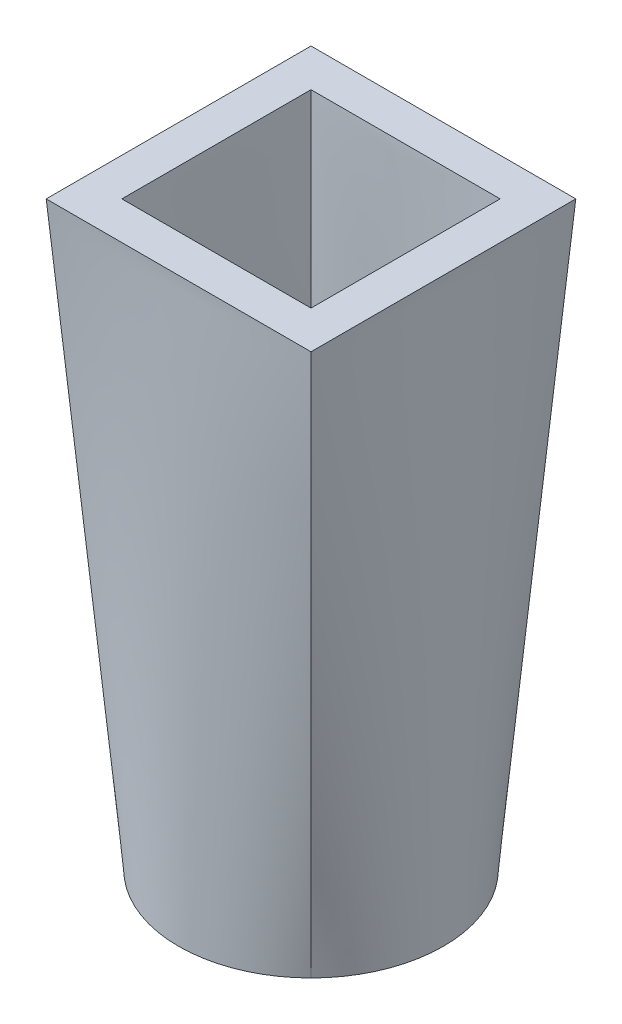
ISO-10303-21;
HEADER;
FILE_DESCRIPTION(('STEP AP214'),'2;1');
FILE_NAME('part.step','',(''),(''),'','','');
FILE_SCHEMA(('AUTOMOTIVE_DESIGN { 1 0 10303 214 1 1 1 1 }'));
ENDSEC;
DATA;
#1=APPLICATION_CONTEXT('core data for automotive mechanical design processes');
#2=APPLICATION_PROTOCOL_DEFINITION('international standard','automotive_design',2000,#1);
#3=PRODUCT_CONTEXT('',#1,'mechanical');
#4=PRODUCT('Part','Part','',(#3));
#5=PRODUCT_RELATED_PRODUCT_CATEGORY('part','',(#4));
#6=PRODUCT_DEFINITION_FORMATION('','',#4);
#7=PRODUCT_DEFINITION_CONTEXT('part definition',#1,'design');
#8=PRODUCT_DEFINITION('design','',#6,#7);
#9=PRODUCT_DEFINITION_SHAPE('','',#8);
#10=(LENGTH_UNIT() NAMED_UNIT(*) SI_UNIT(.MILLI.,.METRE.));
#11=(NAMED_UNIT(*) PLANE_ANGLE_UNIT() SI_UNIT($,.RADIAN.));
#12=(NAMED_UNIT(*) SI_UNIT($,.STERADIAN.) SOLID_ANGLE_UNIT());
#13=UNCERTAINTY_MEASURE_WITH_UNIT(LENGTH_MEASURE(1.E-05),#10,'distance_accuracy_value','');
#14=(GEOMETRIC_REPRESENTATION_CONTEXT(3) GLOBAL_UNCERTAINTY_ASSIGNED_CONTEXT((#13)) GLOBAL_UNIT_ASSIGNED_CONTEXT((#10,
#11,#12)) REPRESENTATION_CONTEXT('',''));
#15=CARTESIAN_POINT('',(0.,0.,0.));
#16=DIRECTION('',(0.,0.,1.));
#17=DIRECTION('',(1.,0.,0.));
#18=AXIS2_PLACEMENT_3D('',#15,#16,#17);
#19=CARTESIAN_POINT('',(0.,0.,0.));
#20=DIRECTION('',(0.,1.,0.));
#21=DIRECTION('',(0.,0.,1.));
#22=AXIS2_PLACEMENT_3D('',#19,#20,#21);
#23=PLANE('',#22);
#24=CARTESIAN_POINT('',(0.,0.,0.));
#25=DIRECTION('',(0.,1.,0.));
#26=DIRECTION('',(0.,0.,1.));
#27=AXIS2_PLACEMENT_3D('',#24,#25,#26);
#28=CIRCLE('',#27,25.);
#29=CARTESIAN_POINT('',(-17.6776695296637,0.,17.6776695296636));
#30=VERTEX_POINT('',#29);
#31=CARTESIAN_POINT('',(17.6776695296637,0.,17.6776695296637));
#32=VERTEX_POINT('',#31);
#33=EDGE_CURVE('E95',#30,#32,#28,.T.);
#34=ORIENTED_EDGE('',*,*,#33,.T.);
#35=CARTESIAN_POINT('',(17.6776695296637,0.,-17.6776695296637));
#36=VERTEX_POINT('',#35);
#37=EDGE_CURVE('E160',#32,#36,#28,.T.);
#38=ORIENTED_EDGE('',*,*,#37,.T.);
#39=CARTESIAN_POINT('',(-17.6776695296636,0.,-17.6776695296637));
#40=VERTEX_POINT('',#39);
#41=EDGE_CURVE('E172',#36,#40,#28,.T.);
#42=ORIENTED_EDGE('',*,*,#41,.T.);
#43=EDGE_CURVE('E182',#40,#30,#28,.T.);
#44=ORIENTED_EDGE('',*,*,#43,.T.);
#45=EDGE_LOOP('',(#34,#38,#42,#44));
#46=FACE_BOUND('',#45,.T.);
#47=CARTESIAN_POINT('',(0.,0.,0.));
#48=DIRECTION('',(0.,1.,0.));
#49=DIRECTION('',(0.,0.,1.));
#50=AXIS2_PLACEMENT_3D('',#47,#48,#49);
#51=CIRCLE('',#50,35.);
#52=CARTESIAN_POINT('',(24.7487373415291,0.,24.7487373415292));
#53=VERTEX_POINT('',#52);
#54=CARTESIAN_POINT('',(24.7487373415292,0.,-24.7487373415291));
#55=VERTEX_POINT('',#54);
#56=EDGE_CURVE('E171',#53,#55,#51,.T.);
#57=ORIENTED_EDGE('',*,*,#56,.F.);
#58=CARTESIAN_POINT('',(0.,0.,0.));
#59=DIRECTION('',(0.,1.,0.));
#60=DIRECTION('',(0.,0.,1.));
#61=AXIS2_PLACEMENT_3D('',#58,#59,#60);
#62=CIRCLE('',#61,35.);
#63=CARTESIAN_POINT('',(-24.7487373415292,0.,24.7487373415291));
#64=VERTEX_POINT('',#63);
#65=EDGE_CURVE('E589',#64,#53,#62,.T.);
#66=ORIENTED_EDGE('',*,*,#65,.F.);
#67=CARTESIAN_POINT('',(0.,0.,0.));
#68=DIRECTION('',(0.,1.,0.));
#69=DIRECTION('',(0.,0.,1.));
#70=AXIS2_PLACEMENT_3D('',#67,#68,#69);
#71=CIRCLE('',#70,35.);
#72=CARTESIAN_POINT('',(-24.7487373415291,0.,-24.7487373415292));
#73=VERTEX_POINT('',#72);
#74=EDGE_CURVE('E579',#73,#64,#71,.T.);
#75=ORIENTED_EDGE('',*,*,#74,.F.);
#76=CARTESIAN_POINT('',(0.,0.,0.));
#77=DIRECTION('',(0.,1.,0.));
#78=DIRECTION('',(0.,0.,1.));
#79=AXIS2_PLACEMENT_3D('',#76,#77,#78);
#80=CIRCLE('',#79,35.);
#81=EDGE_CURVE('E569',#55,#73,#80,.T.);
#82=ORIENTED_EDGE('',*,*,#81,.F.);
#83=EDGE_LOOP('',(#57,#66,#75,#82));
#84=FACE_BOUND('',#83,.T.);
#85=ADVANCED_FACE('F91',(#46,#84),#23,.F.);
#86=CARTESIAN_POINT('',(0.,153.617019002257,0.));
#87=DIRECTION('',(0.,-1.,0.));
#88=DIRECTION('',(0.,0.,-1.));
#89=AXIS2_PLACEMENT_3D('',#86,#87,#88);
#90=PLANE('',#89);
#91=DIRECTION('',(-1.,0.,0.));
#92=VECTOR('',#91,1.);
#93=CARTESIAN_POINT('',(-25.,153.617019002257,-25.));
#94=LINE('',#93,#92);
#95=CARTESIAN_POINT('',(25.,153.617019002257,-25.));
#96=VERTEX_POINT('',#95);
#97=CARTESIAN_POINT('',(-25.,153.617019002257,-25.));
#98=VERTEX_POINT('',#97);
#99=EDGE_CURVE('E216',#96,#98,#94,.T.);
#100=ORIENTED_EDGE('',*,*,#99,.F.);
#101=DIRECTION('',(0.,0.,-1.));
#102=VECTOR('',#101,1.);
#103=CARTESIAN_POINT('',(25.,153.617019002257,25.));
#104=LINE('',#103,#102);
#105=CARTESIAN_POINT('',(25.,153.617019002257,25.));
#106=VERTEX_POINT('',#105);
#107=EDGE_CURVE('E227',#106,#96,#104,.T.);
#108=ORIENTED_EDGE('',*,*,#107,.F.);
#109=DIRECTION('',(1.,0.,0.));
#110=VECTOR('',#109,1.);
#111=CARTESIAN_POINT('',(-25.,153.617019002257,25.));
#112=LINE('',#111,#110);
#113=CARTESIAN_POINT('',(-25.,153.617019002257,25.));
#114=VERTEX_POINT('',#113);
#115=EDGE_CURVE('E176',#114,#106,#112,.T.);
#116=ORIENTED_EDGE('',*,*,#115,.F.);
#117=DIRECTION('',(0.,0.,1.));
#118=VECTOR('',#117,1.);
#119=CARTESIAN_POINT('',(-25.,153.617019002257,25.));
#120=LINE('',#119,#118);
#121=EDGE_CURVE('E208',#98,#114,#120,.T.);
#122=ORIENTED_EDGE('',*,*,#121,.F.);
#123=EDGE_LOOP('',(#100,#108,#116,#122));
#124=FACE_BOUND('',#123,.T.);
#125=DIRECTION('',(0.,0.,-1.));
#126=VECTOR('',#125,1.);
#127=CARTESIAN_POINT('',(35.,153.617019002257,35.));
#128=LINE('',#127,#126);
#129=CARTESIAN_POINT('',(35.,153.617019002257,35.));
#130=VERTEX_POINT('',#129);
#131=CARTESIAN_POINT('',(35.,153.617019002257,-35.));
#132=VERTEX_POINT('',#131);
#133=EDGE_CURVE('E522',#130,#132,#128,.T.);
#134=ORIENTED_EDGE('',*,*,#133,.T.);
#135=DIRECTION('',(1.,0.,0.));
#136=VECTOR('',#135,1.);
#137=CARTESIAN_POINT('',(-35.,153.617019002257,-35.));
#138=LINE('',#137,#136);
#139=CARTESIAN_POINT('',(-35.,153.617019002257,-35.));
#140=VERTEX_POINT('',#139);
#141=EDGE_CURVE('E518',#140,#132,#138,.T.);
#142=ORIENTED_EDGE('',*,*,#141,.F.);
#143=DIRECTION('',(0.,0.,-1.));
#144=VECTOR('',#143,1.);
#145=CARTESIAN_POINT('',(-35.,153.617019002257,35.));
#146=LINE('',#145,#144);
#147=CARTESIAN_POINT('',(-35.,153.617019002257,35.));
#148=VERTEX_POINT('',#147);
#149=EDGE_CURVE('E101',#148,#140,#146,.T.);
#150=ORIENTED_EDGE('',*,*,#149,.F.);
#151=DIRECTION('',(1.,0.,0.));
#152=VECTOR('',#151,1.);
#153=CARTESIAN_POINT('',(-35.,153.617019002257,35.));
#154=LINE('',#153,#152);
#155=EDGE_CURVE('E12',#148,#130,#154,.T.);
#156=ORIENTED_EDGE('',*,*,#155,.T.);
#157=EDGE_LOOP('',(#134,#142,#150,#156));
#158=FACE_BOUND('',#157,.T.);
#159=ADVANCED_FACE('F245',(#124,#158),#90,.F.);
#160=CARTESIAN_POINT('',(-35.,153.617019002257,35.));
#161=CARTESIAN_POINT('',(-24.7487373415292,0.,24.7487373415291));
#162=CARTESIAN_POINT('',(-35.,153.617019002257,32.0833333333333));
#163=CARTESIAN_POINT('',(-26.2070706748625,0.,23.2904040081958));
#164=CARTESIAN_POINT('',(-35.,153.617019002257,29.1666666666667));
#165=CARTESIAN_POINT('',(-27.5902980372642,0.,21.6478916843896));
#166=CARTESIAN_POINT('',(-35.,153.617019002257,23.3333333333333));
#167=CARTESIAN_POINT('',(-30.0875461216728,0.,18.0165293145029));
#168=CARTESIAN_POINT('',(-35.,153.617019002257,20.4166666666666));
#169=CARTESIAN_POINT('',(-31.20075829867,0.,16.0274938237574));
#170=CARTESIAN_POINT('',(-35.,153.617019002257,14.5833333333333));
#171=CARTESIAN_POINT('',(-33.041173161278,0.,11.7749205011775));
#172=CARTESIAN_POINT('',(-35.,153.617019002257,11.6666666666666));
#173=CARTESIAN_POINT('',(-33.7674737720229,0.,9.51171560693941));
#174=CARTESIAN_POINT('',(-35.,153.617019002257,5.83333333333332));
#175=CARTESIAN_POINT('',(-34.7471912688595,0.,4.83194760493541));
#176=CARTESIAN_POINT('',(-35.,153.617019002257,2.91666666666665));
#177=CARTESIAN_POINT('',(-35.,0.,2.41624578050964));
#178=CARTESIAN_POINT('',(-35.,153.617019002257,-2.91666666666668));
#179=CARTESIAN_POINT('',(-35.,0.,-2.4162457805098));
#180=CARTESIAN_POINT('',(-35.,153.617019002257,-5.83333333333334));
#181=CARTESIAN_POINT('',(-34.7471912688595,0.,-4.83194760493556));
#182=CARTESIAN_POINT('',(-35.,153.617019002257,-11.6666666666667));
#183=CARTESIAN_POINT('',(-33.7674737720228,0.,-9.51171560693956));
#184=CARTESIAN_POINT('',(-35.,153.617019002257,-14.5833333333333));
#185=CARTESIAN_POINT('',(-33.0411731612779,0.,-11.7749205011776));
#186=CARTESIAN_POINT('',(-35.,153.617019002257,-20.4166666666667));
#187=CARTESIAN_POINT('',(-31.20075829867,0.,-16.0274938237575));
#188=CARTESIAN_POINT('',(-35.,153.617019002257,-23.3333333333333));
#189=CARTESIAN_POINT('',(-30.0875461216727,0.,-18.016529314503));
#190=CARTESIAN_POINT('',(-35.,153.617019002257,-29.1666666666667));
#191=CARTESIAN_POINT('',(-27.5902980372641,0.,-21.6478916843897));
#192=CARTESIAN_POINT('',(-35.,153.617019002257,-32.0833333333333));
#193=CARTESIAN_POINT('',(-26.2070706748624,0.,-23.2904040081959));
#194=CARTESIAN_POINT('',(-35.,153.617019002257,-35.));
#195=CARTESIAN_POINT('',(-24.7487373415291,0.,-24.7487373415292));
#196=B_SPLINE_SURFACE_WITH_KNOTS('',3,1,((#160,#161),(#162,#163),(#164,#165),(#166,#167),(#168,
#169),(#170,#171),(#172,#173),(#174,#175),(#176,#177),(#178,#179),(#180,#181),(#182,#183),(#184,
#185),(#186,#187),(#188,#189),(#190,#191),(#192,#193),(#194,#195)),.UNSPECIFIED.,.F.,.F.,.F.,(4,
2,2,2,2,2,2,2,4),(2,2),(0.,0.125,0.25,0.375,0.5,0.625,0.75,0.875,1.),(0.,1.),.UNSPECIFIED.);
#197=DIRECTION('',(0.0664373914767903,-0.995576288401607,0.0664373914767895));
#198=VECTOR('',#197,1.);
#199=CARTESIAN_POINT('',(-29.8743686707646,76.8085095011283,-29.8743686707646));
#200=LINE('',#199,#198);
#201=EDGE_CURVE('E527',#140,#73,#200,.T.);
#202=DIRECTION('',(-0.0664373914767896,0.995576288401607,0.0664373914767902));
#203=VECTOR('',#202,1.);
#204=CARTESIAN_POINT('',(-29.8743686707646,76.8085095011283,29.8743686707646));
#205=LINE('',#204,#203);
#206=EDGE_CURVE('E528',#64,#148,#205,.T.);
#207=ORIENTED_EDGE('',*,*,#149,.T.);
#208=ORIENTED_EDGE('',*,*,#201,.T.);
#209=ORIENTED_EDGE('',*,*,#74,.T.);
#210=ORIENTED_EDGE('',*,*,#206,.T.);
#211=EDGE_LOOP('',(#207,#208,#209,#210));
#212=FACE_BOUND('',#211,.T.);
#213=ADVANCED_FACE('F267',(#212),#196,.T.);
#214=CARTESIAN_POINT('',(-35.,153.617019002257,-35.));
#215=CARTESIAN_POINT('',(-24.7487373415291,0.,-24.7487373415292));
#216=CARTESIAN_POINT('',(-32.0833333333333,153.617019002257,-35.));
#217=CARTESIAN_POINT('',(-23.2904040081958,0.,-26.2070706748626));
#218=CARTESIAN_POINT('',(-29.1666666666667,153.617019002257,-35.));
#219=CARTESIAN_POINT('',(-21.6478916843896,0.,-27.5902980372642));
#220=CARTESIAN_POINT('',(-23.3333333333333,153.617019002257,-35.));
#221=CARTESIAN_POINT('',(-18.0165293145029,0.,-30.0875461216728));
#222=CARTESIAN_POINT('',(-20.4166666666667,153.617019002257,-35.));
#223=CARTESIAN_POINT('',(-16.0274938237573,0.,-31.20075829867));
#224=CARTESIAN_POINT('',(-14.5833333333333,153.617019002257,-35.));
#225=CARTESIAN_POINT('',(-11.7749205011775,0.,-33.041173161278));
#226=CARTESIAN_POINT('',(-11.6666666666667,153.617019002257,-35.));
#227=CARTESIAN_POINT('',(-9.51171560693942,0.,-33.7674737720229));
#228=CARTESIAN_POINT('',(-5.83333333333333,153.617019002257,-35.));
#229=CARTESIAN_POINT('',(-4.83194760493542,0.,-34.7471912688595));
#230=CARTESIAN_POINT('',(-2.91666666666667,153.617019002257,-35.));
#231=CARTESIAN_POINT('',(-2.41624578050965,0.,-35.));
#232=CARTESIAN_POINT('',(2.91666666666666,153.617019002257,-35.));
#233=CARTESIAN_POINT('',(2.41624578050979,0.,-35.));
#234=CARTESIAN_POINT('',(5.83333333333333,153.617019002257,-35.));
#235=CARTESIAN_POINT('',(4.83194760493555,0.,-34.7471912688595));
#236=CARTESIAN_POINT('',(11.6666666666667,153.617019002257,-35.));
#237=CARTESIAN_POINT('',(9.51171560693954,0.,-33.7674737720228));
#238=CARTESIAN_POINT('',(14.5833333333333,153.617019002257,-35.));
#239=CARTESIAN_POINT('',(11.7749205011776,0.,-33.0411731612779));
#240=CARTESIAN_POINT('',(20.4166666666667,153.617019002257,-35.));
#241=CARTESIAN_POINT('',(16.0274938237575,0.,-31.20075829867));
#242=CARTESIAN_POINT('',(23.3333333333333,153.617019002257,-35.));
#243=CARTESIAN_POINT('',(18.016529314503,0.,-30.0875461216727));
#244=CARTESIAN_POINT('',(29.1666666666667,153.617019002257,-35.));
#245=CARTESIAN_POINT('',(21.6478916843897,0.,-27.5902980372641));
#246=CARTESIAN_POINT('',(32.0833333333333,153.617019002257,-35.));
#247=CARTESIAN_POINT('',(23.2904040081959,0.,-26.2070706748625));
#248=CARTESIAN_POINT('',(35.,153.617019002257,-35.));
#249=CARTESIAN_POINT('',(24.7487373415292,0.,-24.7487373415291));
#250=B_SPLINE_SURFACE_WITH_KNOTS('',3,1,((#214,#215),(#216,#217),(#218,#219),(#220,#221),(#222,
#223),(#224,#225),(#226,#227),(#228,#229),(#230,#231),(#232,#233),(#234,#235),(#236,#237),(#238,
#239),(#240,#241),(#242,#243),(#244,#245),(#246,#247),(#248,#249)),.UNSPECIFIED.,.F.,.F.,.F.,(4,
2,2,2,2,2,2,2,4),(2,2),(0.,0.125,0.25,0.375,0.5,0.625,0.75,0.875,1.),(0.,1.),.UNSPECIFIED.);
#251=DIRECTION('',(-0.0664373914767896,-0.995576288401607,0.0664373914767901));
#252=VECTOR('',#251,1.);
#253=CARTESIAN_POINT('',(29.8743686707646,76.8085095011283,-29.8743686707646));
#254=LINE('',#253,#252);
#255=EDGE_CURVE('E531',#132,#55,#254,.T.);
#256=ORIENTED_EDGE('',*,*,#141,.T.);
#257=ORIENTED_EDGE('',*,*,#255,.T.);
#258=ORIENTED_EDGE('',*,*,#81,.T.);
#259=ORIENTED_EDGE('',*,*,#201,.F.);
#260=EDGE_LOOP('',(#256,#257,#258,#259));
#261=FACE_BOUND('',#260,.T.);
#262=ADVANCED_FACE('F424',(#261),#250,.T.);
#263=CARTESIAN_POINT('',(35.,153.617019002257,35.));
#264=CARTESIAN_POINT('',(24.7487373415291,0.,24.7487373415292));
#265=CARTESIAN_POINT('',(32.0833333333333,153.617019002257,35.));
#266=CARTESIAN_POINT('',(23.2904040081958,0.,26.2070706748625));
#267=CARTESIAN_POINT('',(29.1666666666667,153.617019002257,35.));
#268=CARTESIAN_POINT('',(21.6478916843896,0.,27.5902980372642));
#269=CARTESIAN_POINT('',(23.3333333333333,153.617019002257,35.));
#270=CARTESIAN_POINT('',(18.0165293145029,0.,30.0875461216727));
#271=CARTESIAN_POINT('',(20.4166666666666,153.617019002257,35.));
#272=CARTESIAN_POINT('',(16.0274938237574,0.,31.20075829867));
#273=CARTESIAN_POINT('',(14.5833333333333,153.617019002257,35.));
#274=CARTESIAN_POINT('',(11.7749205011775,0.,33.041173161278));
#275=CARTESIAN_POINT('',(11.6666666666666,153.617019002257,35.));
#276=CARTESIAN_POINT('',(9.51171560693942,0.,33.7674737720229));
#277=CARTESIAN_POINT('',(5.83333333333331,153.617019002257,35.));
#278=CARTESIAN_POINT('',(4.83194760493542,0.,34.7471912688595));
#279=CARTESIAN_POINT('',(2.91666666666665,153.617019002257,35.));
#280=CARTESIAN_POINT('',(2.41624578050966,0.,35.));
#281=CARTESIAN_POINT('',(-2.91666666666669,153.617019002257,35.));
#282=CARTESIAN_POINT('',(-2.41624578050979,0.,35.));
#283=CARTESIAN_POINT('',(-5.83333333333336,153.617019002257,35.));
#284=CARTESIAN_POINT('',(-4.83194760493555,0.,34.7471912688595));
#285=CARTESIAN_POINT('',(-11.6666666666667,153.617019002257,35.));
#286=CARTESIAN_POINT('',(-9.51171560693955,0.,33.7674737720228));
#287=CARTESIAN_POINT('',(-14.5833333333334,153.617019002257,35.));
#288=CARTESIAN_POINT('',(-11.7749205011776,0.,33.0411731612779));
#289=CARTESIAN_POINT('',(-20.4166666666667,153.617019002257,35.));
#290=CARTESIAN_POINT('',(-16.0274938237575,0.,31.20075829867));
#291=CARTESIAN_POINT('',(-23.3333333333334,153.617019002257,35.));
#292=CARTESIAN_POINT('',(-18.016529314503,0.,30.0875461216727));
#293=CARTESIAN_POINT('',(-29.1666666666667,153.617019002257,35.));
#294=CARTESIAN_POINT('',(-21.6478916843897,0.,27.5902980372641));
#295=CARTESIAN_POINT('',(-32.0833333333333,153.617019002257,35.));
#296=CARTESIAN_POINT('',(-23.2904040081959,0.,26.2070706748624));
#297=CARTESIAN_POINT('',(-35.,153.617019002257,35.));
#298=CARTESIAN_POINT('',(-24.7487373415292,0.,24.7487373415291));
#299=B_SPLINE_SURFACE_WITH_KNOTS('',3,1,((#263,#264),(#265,#266),(#267,#268),(#269,#270),(#271,
#272),(#273,#274),(#275,#276),(#277,#278),(#279,#280),(#281,#282),(#283,#284),(#285,#286),(#287,
#288),(#289,#290),(#291,#292),(#293,#294),(#295,#296),(#297,#298)),.UNSPECIFIED.,.F.,.F.,.F.,(4,
2,2,2,2,2,2,2,4),(2,2),(0.,0.125,0.25,0.375,0.5,0.625,0.75,0.875,1.),(0.,1.),.UNSPECIFIED.);
#300=DIRECTION('',(-0.0664373914767902,-0.995576288401607,-0.0664373914767896));
#301=VECTOR('',#300,1.);
#302=CARTESIAN_POINT('',(29.8743686707646,76.8085095011283,29.8743686707646));
#303=LINE('',#302,#301);
#304=EDGE_CURVE('E591',#130,#53,#303,.T.);
#305=ORIENTED_EDGE('',*,*,#155,.F.);
#306=ORIENTED_EDGE('',*,*,#206,.F.);
#307=ORIENTED_EDGE('',*,*,#65,.T.);
#308=ORIENTED_EDGE('',*,*,#304,.F.);
#309=EDGE_LOOP('',(#305,#306,#307,#308));
#310=FACE_BOUND('',#309,.T.);
#311=ADVANCED_FACE('F431',(#310),#299,.T.);
#312=CARTESIAN_POINT('',(35.,153.617019002257,-35.));
#313=CARTESIAN_POINT('',(24.7487373415292,0.,-24.7487373415291));
#314=CARTESIAN_POINT('',(35.,153.617019002257,-32.0833333333333));
#315=CARTESIAN_POINT('',(26.2070706748625,0.,-23.2904040081958));
#316=CARTESIAN_POINT('',(35.,153.617019002257,-29.1666666666667));
#317=CARTESIAN_POINT('',(27.5902980372642,0.,-21.6478916843896));
#318=CARTESIAN_POINT('',(35.,153.617019002257,-23.3333333333333));
#319=CARTESIAN_POINT('',(30.0875461216727,0.,-18.0165293145029));
#320=CARTESIAN_POINT('',(35.,153.617019002257,-20.4166666666667));
#321=CARTESIAN_POINT('',(31.20075829867,0.,-16.0274938237574));
#322=CARTESIAN_POINT('',(35.,153.617019002257,-14.5833333333333));
#323=CARTESIAN_POINT('',(33.041173161278,0.,-11.7749205011775));
#324=CARTESIAN_POINT('',(35.,153.617019002257,-11.6666666666667));
#325=CARTESIAN_POINT('',(33.7674737720229,0.,-9.51171560693943));
#326=CARTESIAN_POINT('',(35.,153.617019002257,-5.83333333333334));
#327=CARTESIAN_POINT('',(34.7471912688595,0.,-4.83194760493543));
#328=CARTESIAN_POINT('',(35.,153.617019002257,-2.91666666666667));
#329=CARTESIAN_POINT('',(35.,0.,-2.41624578050967));
#330=CARTESIAN_POINT('',(35.,153.617019002257,2.91666666666666));
#331=CARTESIAN_POINT('',(35.,0.,2.41624578050977));
#332=CARTESIAN_POINT('',(35.,153.617019002257,5.83333333333332));
#333=CARTESIAN_POINT('',(34.7471912688595,0.,4.83194760493554));
#334=CARTESIAN_POINT('',(35.,153.617019002257,11.6666666666666));
#335=CARTESIAN_POINT('',(33.7674737720228,0.,9.51171560693954));
#336=CARTESIAN_POINT('',(35.,153.617019002257,14.5833333333333));
#337=CARTESIAN_POINT('',(33.0411731612779,0.,11.7749205011776));
#338=CARTESIAN_POINT('',(35.,153.617019002257,20.4166666666666));
#339=CARTESIAN_POINT('',(31.20075829867,0.,16.0274938237575));
#340=CARTESIAN_POINT('',(35.,153.617019002257,23.3333333333333));
#341=CARTESIAN_POINT('',(30.0875461216727,0.,18.016529314503));
#342=CARTESIAN_POINT('',(35.,153.617019002257,29.1666666666667));
#343=CARTESIAN_POINT('',(27.5902980372641,0.,21.6478916843897));
#344=CARTESIAN_POINT('',(35.,153.617019002257,32.0833333333333));
#345=CARTESIAN_POINT('',(26.2070706748625,0.,23.2904040081959));
#346=CARTESIAN_POINT('',(35.,153.617019002257,35.));
#347=CARTESIAN_POINT('',(24.7487373415291,0.,24.7487373415292));
#348=B_SPLINE_SURFACE_WITH_KNOTS('',3,1,((#312,#313),(#314,#315),(#316,#317),(#318,#319),(#320,
#321),(#322,#323),(#324,#325),(#326,#327),(#328,#329),(#330,#331),(#332,#333),(#334,#335),(#336,
#337),(#338,#339),(#340,#341),(#342,#343),(#344,#345),(#346,#347)),.UNSPECIFIED.,.F.,.F.,.F.,(4,
2,2,2,2,2,2,2,4),(2,2),(0.,0.125,0.25,0.375,0.5,0.625,0.75,0.875,1.),(0.,1.),.UNSPECIFIED.);
#349=ORIENTED_EDGE('',*,*,#133,.F.);
#350=ORIENTED_EDGE('',*,*,#304,.T.);
#351=ORIENTED_EDGE('',*,*,#56,.T.);
#352=ORIENTED_EDGE('',*,*,#255,.F.);
#353=EDGE_LOOP('',(#349,#350,#351,#352));
#354=FACE_BOUND('',#353,.T.);
#355=ADVANCED_FACE('F340',(#354),#348,.T.);
#356=CARTESIAN_POINT('',(17.6776695296637,0.,17.6776695296637));
#357=CARTESIAN_POINT('',(25.,153.617019002257,25.));
#358=CARTESIAN_POINT('',(18.7193361963303,0.,16.6360028629971));
#359=CARTESIAN_POINT('',(25.,153.617019002257,22.9166666666667));
#360=CARTESIAN_POINT('',(19.7073557409029,0.,15.462779774564));
#361=CARTESIAN_POINT('',(25.,153.617019002257,20.8333333333333));
#362=CARTESIAN_POINT('',(21.4911043726233,0.,12.8689495103593));
#363=CARTESIAN_POINT('',(25.,153.617019002257,16.6666666666667));
#364=CARTESIAN_POINT('',(22.2862559276214,0.,11.4482098741125));
#365=CARTESIAN_POINT('',(25.,153.617019002257,14.5833333333333));
#366=CARTESIAN_POINT('',(23.6008379723414,0.,8.41065750084114));
#367=CARTESIAN_POINT('',(25.,153.617019002257,10.4166666666667));
#368=CARTESIAN_POINT('',(24.1196241228734,0.,6.79408257638539));
#369=CARTESIAN_POINT('',(25.,153.617019002257,8.33333333333333));
#370=CARTESIAN_POINT('',(24.8194223348996,0.,3.45139114638253));
#371=CARTESIAN_POINT('',(25.,153.617019002257,4.16666666666666));
#372=CARTESIAN_POINT('',(25.,0.,1.72588984322127));
#373=CARTESIAN_POINT('',(25.,153.617019002257,2.08333333333333));
#374=CARTESIAN_POINT('',(25.,0.,-1.72588984322119));
#375=CARTESIAN_POINT('',(25.,153.617019002257,-2.08333333333334));
#376=CARTESIAN_POINT('',(24.8194223348996,0.,-3.45139114638245));
#377=CARTESIAN_POINT('',(25.,153.617019002257,-4.16666666666667));
#378=CARTESIAN_POINT('',(24.1196241228735,0.,-6.79408257638531));
#379=CARTESIAN_POINT('',(25.,153.617019002257,-8.33333333333334));
#380=CARTESIAN_POINT('',(23.6008379723414,0.,-8.41065750084106));
#381=CARTESIAN_POINT('',(25.,153.617019002257,-10.4166666666667));
#382=CARTESIAN_POINT('',(22.2862559276214,0.,-11.4482098741124));
#383=CARTESIAN_POINT('',(25.,153.617019002257,-14.5833333333333));
#384=CARTESIAN_POINT('',(21.4911043726234,0.,-12.8689495103592));
#385=CARTESIAN_POINT('',(25.,153.617019002257,-16.6666666666667));
#386=CARTESIAN_POINT('',(19.707355740903,0.,-15.462779774564));
#387=CARTESIAN_POINT('',(25.,153.617019002257,-20.8333333333333));
#388=CARTESIAN_POINT('',(18.7193361963304,0.,-16.636002862997));
#389=CARTESIAN_POINT('',(25.,153.617019002257,-22.9166666666667));
#390=CARTESIAN_POINT('',(17.6776695296637,0.,-17.6776695296637));
#391=CARTESIAN_POINT('',(25.,153.617019002257,-25.));
#392=B_SPLINE_SURFACE_WITH_KNOTS('',3,1,((#356,#357),(#358,#359),(#360,#361),(#362,#363),(#364,
#365),(#366,#367),(#368,#369),(#370,#371),(#372,#373),(#374,#375),(#376,#377),(#378,#379),(#380,
#381),(#382,#383),(#384,#385),(#386,#387),(#388,#389),(#390,#391)),.UNSPECIFIED.,.F.,.F.,.F.,(4,
2,2,2,2,2,2,2,4),(2,2),(0.,0.125,0.25,0.375,0.5,0.625,0.75,0.875,1.),(0.,1.),.UNSPECIFIED.);
#393=DIRECTION('',(-0.0475582082129061,-0.997735653198359,-0.0475582082129057));
#394=VECTOR('',#393,1.);
#395=CARTESIAN_POINT('',(21.3388347648318,76.8085095011283,21.3388347648319));
#396=LINE('',#395,#394);
#397=EDGE_CURVE('E163',#106,#32,#396,.T.);
#398=DIRECTION('',(0.0475582082129058,0.997735653198359,-0.0475582082129061));
#399=VECTOR('',#398,1.);
#400=CARTESIAN_POINT('',(21.3388347648319,76.8085095011283,-21.3388347648318));
#401=LINE('',#400,#399);
#402=EDGE_CURVE('E166',#36,#96,#401,.T.);
#403=ORIENTED_EDGE('',*,*,#37,.F.);
#404=ORIENTED_EDGE('',*,*,#397,.F.);
#405=ORIENTED_EDGE('',*,*,#107,.T.);
#406=ORIENTED_EDGE('',*,*,#402,.F.);
#407=EDGE_LOOP('',(#403,#404,#405,#406));
#408=FACE_BOUND('',#407,.T.);
#409=ADVANCED_FACE('F162',(#408),#392,.F.);
#410=CARTESIAN_POINT('',(17.6776695296637,0.,-17.6776695296637));
#411=CARTESIAN_POINT('',(25.,153.617019002257,-25.));
#412=CARTESIAN_POINT('',(16.6360028629971,0.,-18.7193361963303));
#413=CARTESIAN_POINT('',(22.9166666666667,153.617019002257,-25.));
#414=CARTESIAN_POINT('',(15.4627797745641,0.,-19.7073557409029));
#415=CARTESIAN_POINT('',(20.8333333333333,153.617019002257,-25.));
#416=CARTESIAN_POINT('',(12.8689495103593,0.,-21.4911043726233));
#417=CARTESIAN_POINT('',(16.6666666666667,153.617019002257,-25.));
#418=CARTESIAN_POINT('',(11.4482098741125,0.,-22.2862559276214));
#419=CARTESIAN_POINT('',(14.5833333333333,153.617019002257,-25.));
#420=CARTESIAN_POINT('',(8.41065750084115,0.,-23.6008379723414));
#421=CARTESIAN_POINT('',(10.4166666666667,153.617019002257,-25.));
#422=CARTESIAN_POINT('',(6.79408257638539,0.,-24.1196241228734));
#423=CARTESIAN_POINT('',(8.33333333333333,153.617019002257,-25.));
#424=CARTESIAN_POINT('',(3.45139114638254,0.,-24.8194223348996));
#425=CARTESIAN_POINT('',(4.16666666666666,153.617019002257,-25.));
#426=CARTESIAN_POINT('',(1.72588984322128,0.,-25.));
#427=CARTESIAN_POINT('',(2.08333333333333,153.617019002257,-25.));
#428=CARTESIAN_POINT('',(-1.72588984322117,0.,-25.));
#429=CARTESIAN_POINT('',(-2.08333333333334,153.617019002257,-25.));
#430=CARTESIAN_POINT('',(-3.45139114638243,0.,-24.8194223348996));
#431=CARTESIAN_POINT('',(-4.16666666666667,153.617019002257,-25.));
#432=CARTESIAN_POINT('',(-6.79408257638529,0.,-24.1196241228735));
#433=CARTESIAN_POINT('',(-8.33333333333334,153.617019002257,-25.));
#434=CARTESIAN_POINT('',(-8.41065750084104,0.,-23.6008379723414));
#435=CARTESIAN_POINT('',(-10.4166666666667,153.617019002257,-25.));
#436=CARTESIAN_POINT('',(-11.4482098741124,0.,-22.2862559276215));
#437=CARTESIAN_POINT('',(-14.5833333333333,153.617019002257,-25.));
#438=CARTESIAN_POINT('',(-12.8689495103592,0.,-21.4911043726234));
#439=CARTESIAN_POINT('',(-16.6666666666667,153.617019002257,-25.));
#440=CARTESIAN_POINT('',(-15.462779774564,0.,-19.707355740903));
#441=CARTESIAN_POINT('',(-20.8333333333333,153.617019002257,-25.));
#442=CARTESIAN_POINT('',(-16.636002862997,0.,-18.7193361963304));
#443=CARTESIAN_POINT('',(-22.9166666666667,153.617019002257,-25.));
#444=CARTESIAN_POINT('',(-17.6776695296636,0.,-17.6776695296637));
#445=CARTESIAN_POINT('',(-25.,153.617019002257,-25.));
#446=B_SPLINE_SURFACE_WITH_KNOTS('',3,1,((#410,#411),(#412,#413),(#414,#415),(#416,#417),(#418,
#419),(#420,#421),(#422,#423),(#424,#425),(#426,#427),(#428,#429),(#430,#431),(#432,#433),(#434,
#435),(#436,#437),(#438,#439),(#440,#441),(#442,#443),(#444,#445)),.UNSPECIFIED.,.F.,.F.,.F.,(4,
2,2,2,2,2,2,2,4),(2,2),(0.,0.125,0.25,0.375,0.5,0.625,0.75,0.875,1.),(0.,1.),.UNSPECIFIED.);
#447=DIRECTION('',(-0.0475582082129062,0.997735653198359,-0.0475582082129056));
#448=VECTOR('',#447,1.);
#449=CARTESIAN_POINT('',(-21.3388347648318,76.8085095011283,-21.3388347648319));
#450=LINE('',#449,#448);
#451=EDGE_CURVE('E117',#40,#98,#450,.T.);
#452=ORIENTED_EDGE('',*,*,#41,.F.);
#453=ORIENTED_EDGE('',*,*,#402,.T.);
#454=ORIENTED_EDGE('',*,*,#99,.T.);
#455=ORIENTED_EDGE('',*,*,#451,.F.);
#456=EDGE_LOOP('',(#452,#453,#454,#455));
#457=FACE_BOUND('',#456,.T.);
#458=ADVANCED_FACE('F239',(#457),#446,.F.);
#459=CARTESIAN_POINT('',(-17.6776695296637,0.,17.6776695296636));
#460=CARTESIAN_POINT('',(-25.,153.617019002257,25.));
#461=CARTESIAN_POINT('',(-16.6360028629971,0.,18.7193361963303));
#462=CARTESIAN_POINT('',(-22.9166666666667,153.617019002257,25.));
#463=CARTESIAN_POINT('',(-15.4627797745641,0.,19.7073557409029));
#464=CARTESIAN_POINT('',(-20.8333333333333,153.617019002257,25.));
#465=CARTESIAN_POINT('',(-12.8689495103593,0.,21.4911043726233));
#466=CARTESIAN_POINT('',(-16.6666666666667,153.617019002257,25.));
#467=CARTESIAN_POINT('',(-11.4482098741125,0.,22.2862559276214));
#468=CARTESIAN_POINT('',(-14.5833333333333,153.617019002257,25.));
#469=CARTESIAN_POINT('',(-8.41065750084116,0.,23.6008379723414));
#470=CARTESIAN_POINT('',(-10.4166666666666,153.617019002257,25.));
#471=CARTESIAN_POINT('',(-6.79408257638541,0.,24.1196241228734));
#472=CARTESIAN_POINT('',(-8.33333333333331,153.617019002257,25.));
#473=CARTESIAN_POINT('',(-3.45139114638255,0.,24.8194223348996));
#474=CARTESIAN_POINT('',(-4.16666666666665,153.617019002257,25.));
#475=CARTESIAN_POINT('',(-1.72588984322129,0.,25.));
#476=CARTESIAN_POINT('',(-2.08333333333332,153.617019002257,25.));
#477=CARTESIAN_POINT('',(1.72588984322117,0.,25.));
#478=CARTESIAN_POINT('',(2.08333333333334,153.617019002257,25.));
#479=CARTESIAN_POINT('',(3.45139114638244,0.,24.8194223348996));
#480=CARTESIAN_POINT('',(4.16666666666668,153.617019002257,25.));
#481=CARTESIAN_POINT('',(6.7940825763853,0.,24.1196241228735));
#482=CARTESIAN_POINT('',(8.33333333333335,153.617019002257,25.));
#483=CARTESIAN_POINT('',(8.41065750084106,0.,23.6008379723414));
#484=CARTESIAN_POINT('',(10.4166666666667,153.617019002257,25.));
#485=CARTESIAN_POINT('',(11.4482098741124,0.,22.2862559276214));
#486=CARTESIAN_POINT('',(14.5833333333333,153.617019002257,25.));
#487=CARTESIAN_POINT('',(12.8689495103592,0.,21.4911043726234));
#488=CARTESIAN_POINT('',(16.6666666666667,153.617019002257,25.));
#489=CARTESIAN_POINT('',(15.462779774564,0.,19.707355740903));
#490=CARTESIAN_POINT('',(20.8333333333333,153.617019002257,25.));
#491=CARTESIAN_POINT('',(16.636002862997,0.,18.7193361963304));
#492=CARTESIAN_POINT('',(22.9166666666667,153.617019002257,25.));
#493=CARTESIAN_POINT('',(17.6776695296637,0.,17.6776695296637));
#494=CARTESIAN_POINT('',(25.,153.617019002257,25.));
#495=B_SPLINE_SURFACE_WITH_KNOTS('',3,1,((#459,#460),(#461,#462),(#463,#464),(#465,#466),(#467,
#468),(#469,#470),(#471,#472),(#473,#474),(#475,#476),(#477,#478),(#479,#480),(#481,#482),(#483,
#484),(#485,#486),(#487,#488),(#489,#490),(#491,#492),(#493,#494)),.UNSPECIFIED.,.F.,.F.,.F.,(4,
2,2,2,2,2,2,2,4),(2,2),(0.,0.125,0.25,0.375,0.5,0.625,0.75,0.875,1.),(0.,1.),.UNSPECIFIED.);
#496=DIRECTION('',(-0.0475582082129056,0.997735653198359,0.0475582082129063));
#497=VECTOR('',#496,1.);
#498=CARTESIAN_POINT('',(-21.3388347648319,76.8085095011283,21.3388347648318));
#499=LINE('',#498,#497);
#500=EDGE_CURVE('E373',#30,#114,#499,.T.);
#501=ORIENTED_EDGE('',*,*,#33,.F.);
#502=ORIENTED_EDGE('',*,*,#500,.T.);
#503=ORIENTED_EDGE('',*,*,#115,.T.);
#504=ORIENTED_EDGE('',*,*,#397,.T.);
#505=EDGE_LOOP('',(#501,#502,#503,#504));
#506=FACE_BOUND('',#505,.T.);
#507=ADVANCED_FACE('F174',(#506),#495,.F.);
#508=CARTESIAN_POINT('',(-17.6776695296636,0.,-17.6776695296637));
#509=CARTESIAN_POINT('',(-25.,153.617019002257,-25.));
#510=CARTESIAN_POINT('',(-18.7193361963303,0.,-16.6360028629971));
#511=CARTESIAN_POINT('',(-25.,153.617019002257,-22.9166666666667));
#512=CARTESIAN_POINT('',(-19.7073557409029,0.,-15.4627797745641));
#513=CARTESIAN_POINT('',(-25.,153.617019002257,-20.8333333333333));
#514=CARTESIAN_POINT('',(-21.4911043726233,0.,-12.8689495103593));
#515=CARTESIAN_POINT('',(-25.,153.617019002257,-16.6666666666667));
#516=CARTESIAN_POINT('',(-22.2862559276214,0.,-11.4482098741125));
#517=CARTESIAN_POINT('',(-25.,153.617019002257,-14.5833333333333));
#518=CARTESIAN_POINT('',(-23.6008379723414,0.,-8.41065750084116));
#519=CARTESIAN_POINT('',(-25.,153.617019002257,-10.4166666666667));
#520=CARTESIAN_POINT('',(-24.1196241228734,0.,-6.79408257638541));
#521=CARTESIAN_POINT('',(-25.,153.617019002257,-8.33333333333333));
#522=CARTESIAN_POINT('',(-24.8194223348996,0.,-3.45139114638256));
#523=CARTESIAN_POINT('',(-25.,153.617019002257,-4.16666666666666));
#524=CARTESIAN_POINT('',(-25.,0.,-1.7258898432213));
#525=CARTESIAN_POINT('',(-25.,153.617019002257,-2.08333333333333));
#526=CARTESIAN_POINT('',(-25.,0.,1.72588984322116));
#527=CARTESIAN_POINT('',(-25.,153.617019002257,2.08333333333334));
#528=CARTESIAN_POINT('',(-24.8194223348996,0.,3.45139114638242));
#529=CARTESIAN_POINT('',(-25.,153.617019002257,4.16666666666667));
#530=CARTESIAN_POINT('',(-24.1196241228735,0.,6.79408257638528));
#531=CARTESIAN_POINT('',(-25.,153.617019002257,8.33333333333334));
#532=CARTESIAN_POINT('',(-23.6008379723414,0.,8.41065750084103));
#533=CARTESIAN_POINT('',(-25.,153.617019002257,10.4166666666667));
#534=CARTESIAN_POINT('',(-22.2862559276215,0.,11.4482098741124));
#535=CARTESIAN_POINT('',(-25.,153.617019002257,14.5833333333333));
#536=CARTESIAN_POINT('',(-21.4911043726234,0.,12.8689495103592));
#537=CARTESIAN_POINT('',(-25.,153.617019002257,16.6666666666667));
#538=CARTESIAN_POINT('',(-19.707355740903,0.,15.462779774564));
#539=CARTESIAN_POINT('',(-25.,153.617019002257,20.8333333333333));
#540=CARTESIAN_POINT('',(-18.7193361963304,0.,16.636002862997));
#541=CARTESIAN_POINT('',(-25.,153.617019002257,22.9166666666667));
#542=CARTESIAN_POINT('',(-17.6776695296637,0.,17.6776695296636));
#543=CARTESIAN_POINT('',(-25.,153.617019002257,25.));
#544=B_SPLINE_SURFACE_WITH_KNOTS('',3,1,((#508,#509),(#510,#511),(#512,#513),(#514,#515),(#516,
#517),(#518,#519),(#520,#521),(#522,#523),(#524,#525),(#526,#527),(#528,#529),(#530,#531),(#532,
#533),(#534,#535),(#536,#537),(#538,#539),(#540,#541),(#542,#543)),.UNSPECIFIED.,.F.,.F.,.F.,(4,
2,2,2,2,2,2,2,4),(2,2),(0.,0.125,0.25,0.375,0.5,0.625,0.75,0.875,1.),(0.,1.),.UNSPECIFIED.);
#545=ORIENTED_EDGE('',*,*,#43,.F.);
#546=ORIENTED_EDGE('',*,*,#451,.T.);
#547=ORIENTED_EDGE('',*,*,#121,.T.);
#548=ORIENTED_EDGE('',*,*,#500,.F.);
#549=EDGE_LOOP('',(#545,#546,#547,#548));
#550=FACE_BOUND('',#549,.T.);
#551=ADVANCED_FACE('F268',(#550),#544,.F.);
#552=CLOSED_SHELL('',(#85,#159,#213,#262,#311,#355,#409,#458,#507,#551));
#553=MANIFOLD_SOLID_BREP('B2',#552);
#554=ADVANCED_BREP_SHAPE_REPRESENTATION('',(#18,#553),#14);
#555=SHAPE_DEFINITION_REPRESENTATION(#9,#554);
ENDSEC;
END-ISO-10303-21;
